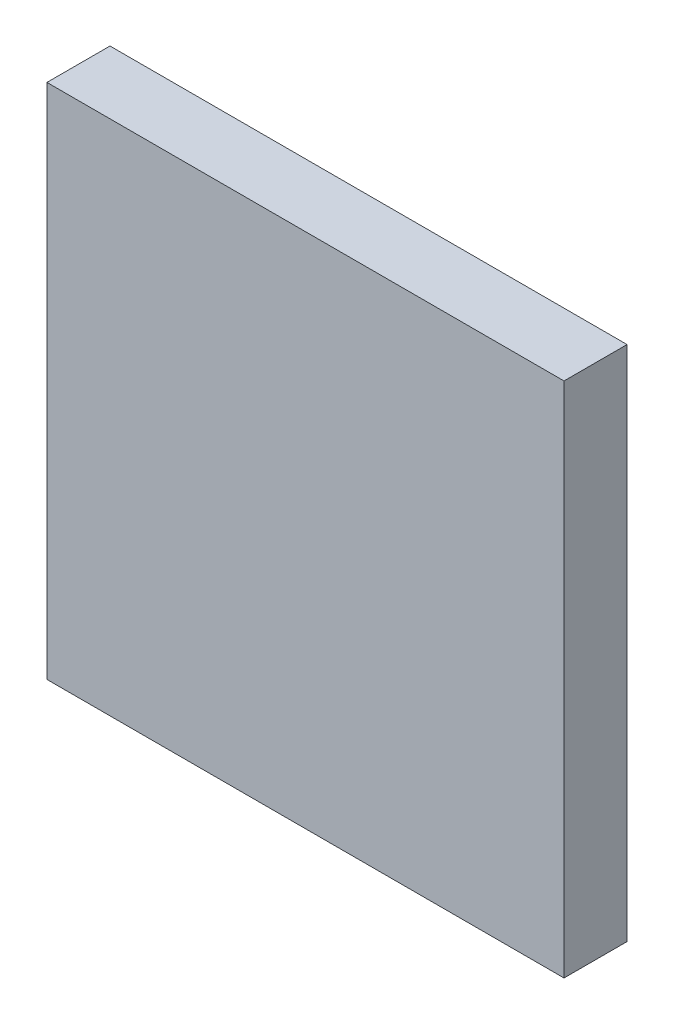
ISO-10303-21;
HEADER;
FILE_DESCRIPTION(('STEP AP214'),'2;1');
FILE_NAME('part.step','',(''),(''),'','','');
FILE_SCHEMA(('AUTOMOTIVE_DESIGN { 1 0 10303 214 1 1 1 1 }'));
ENDSEC;
DATA;
#1=APPLICATION_CONTEXT('core data for automotive mechanical design processes');
#2=APPLICATION_PROTOCOL_DEFINITION('international standard','automotive_design',2000,#1);
#3=PRODUCT_CONTEXT('',#1,'mechanical');
#4=PRODUCT('Part','Part','',(#3));
#5=PRODUCT_RELATED_PRODUCT_CATEGORY('part','',(#4));
#6=PRODUCT_DEFINITION_FORMATION('','',#4);
#7=PRODUCT_DEFINITION_CONTEXT('part definition',#1,'design');
#8=PRODUCT_DEFINITION('design','',#6,#7);
#9=PRODUCT_DEFINITION_SHAPE('','',#8);
#10=(LENGTH_UNIT() NAMED_UNIT(*) SI_UNIT(.MILLI.,.METRE.));
#11=(NAMED_UNIT(*) PLANE_ANGLE_UNIT() SI_UNIT($,.RADIAN.));
#12=(NAMED_UNIT(*) SI_UNIT($,.STERADIAN.) SOLID_ANGLE_UNIT());
#13=UNCERTAINTY_MEASURE_WITH_UNIT(LENGTH_MEASURE(1.E-05),#10,'distance_accuracy_value','');
#14=(GEOMETRIC_REPRESENTATION_CONTEXT(3) GLOBAL_UNCERTAINTY_ASSIGNED_CONTEXT((#13)) GLOBAL_UNIT_ASSIGNED_CONTEXT((#10,
#11,#12)) REPRESENTATION_CONTEXT('',''));
#15=CARTESIAN_POINT('',(0.,0.,0.));
#16=DIRECTION('',(0.,0.,1.));
#17=DIRECTION('',(1.,0.,0.));
#18=AXIS2_PLACEMENT_3D('',#15,#16,#17);
#19=CARTESIAN_POINT('',(-2.04999844,-2.04999844,0.499999));
#20=DIRECTION('',(0.,0.,-1.));
#21=DIRECTION('',(-1.,0.,0.));
#22=AXIS2_PLACEMENT_3D('',#19,#20,#21);
#23=PLANE('',#22);
#24=DIRECTION('',(0.,1.,0.));
#25=VECTOR('',#24,1.);
#26=CARTESIAN_POINT('',(2.05000098,-2.04999844,0.499999));
#27=LINE('',#26,#25);
#28=CARTESIAN_POINT('',(2.05000098,-2.04999844,0.499999));
#29=VERTEX_POINT('',#28);
#30=CARTESIAN_POINT('',(2.05000098,2.05000098,0.499999));
#31=VERTEX_POINT('',#30);
#32=EDGE_CURVE('E54',#29,#31,#27,.T.);
#33=ORIENTED_EDGE('',*,*,#32,.T.);
#34=DIRECTION('',(1.,0.,0.));
#35=VECTOR('',#34,1.);
#36=CARTESIAN_POINT('',(2.05000098,2.05000098,0.499999));
#37=LINE('',#36,#35);
#38=CARTESIAN_POINT('',(-2.04999844,2.05000098,0.499999));
#39=VERTEX_POINT('',#38);
#40=EDGE_CURVE('E56',#31,#39,#37,.F.);
#41=ORIENTED_EDGE('',*,*,#40,.T.);
#42=DIRECTION('',(0.,1.,0.));
#43=VECTOR('',#42,1.);
#44=CARTESIAN_POINT('',(-2.04999844,2.05000098,0.499999));
#45=LINE('',#44,#43);
#46=CARTESIAN_POINT('',(-2.04999844,-2.04999844,0.499999));
#47=VERTEX_POINT('',#46);
#48=EDGE_CURVE('E19',#39,#47,#45,.F.);
#49=ORIENTED_EDGE('',*,*,#48,.T.);
#50=DIRECTION('',(1.,0.,0.));
#51=VECTOR('',#50,1.);
#52=CARTESIAN_POINT('',(-2.04999844,-2.04999844,0.499999));
#53=LINE('',#52,#51);
#54=EDGE_CURVE('E79',#47,#29,#53,.T.);
#55=ORIENTED_EDGE('',*,*,#54,.T.);
#56=EDGE_LOOP('',(#33,#41,#49,#55));
#57=FACE_BOUND('',#56,.T.);
#58=ADVANCED_FACE('F16',(#57),#23,.F.);
#59=CARTESIAN_POINT('',(-2.04999844,2.05000098,0.));
#60=DIRECTION('',(1.,0.,0.));
#61=DIRECTION('',(0.,0.,-1.));
#62=AXIS2_PLACEMENT_3D('',#59,#60,#61);
#63=PLANE('',#62);
#64=DIRECTION('',(0.,0.,1.));
#65=VECTOR('',#64,1.);
#66=CARTESIAN_POINT('',(-2.04999844,-2.04999844,0.));
#67=LINE('',#66,#65);
#68=CARTESIAN_POINT('',(-2.04999844,-2.04999844,0.));
#69=VERTEX_POINT('',#68);
#70=EDGE_CURVE('E67',#69,#47,#67,.T.);
#71=ORIENTED_EDGE('',*,*,#70,.T.);
#72=ORIENTED_EDGE('',*,*,#48,.F.);
#73=DIRECTION('',(0.,0.,-1.));
#74=VECTOR('',#73,1.);
#75=CARTESIAN_POINT('',(-2.04999844,2.05000098,0.));
#76=LINE('',#75,#74);
#77=CARTESIAN_POINT('',(-2.04999844,2.05000098,0.));
#78=VERTEX_POINT('',#77);
#79=EDGE_CURVE('E62',#39,#78,#76,.T.);
#80=ORIENTED_EDGE('',*,*,#79,.T.);
#81=DIRECTION('',(0.,1.,0.));
#82=VECTOR('',#81,1.);
#83=CARTESIAN_POINT('',(-2.04999844,-2.04999844,0.));
#84=LINE('',#83,#82);
#85=EDGE_CURVE('E82',#69,#78,#84,.T.);
#86=ORIENTED_EDGE('',*,*,#85,.F.);
#87=EDGE_LOOP('',(#71,#72,#80,#86));
#88=FACE_BOUND('',#87,.T.);
#89=ADVANCED_FACE('F64',(#88),#63,.F.);
#90=CARTESIAN_POINT('',(2.05000098,2.05000098,0.));
#91=DIRECTION('',(0.,-1.,0.));
#92=DIRECTION('',(0.,0.,-1.));
#93=AXIS2_PLACEMENT_3D('',#90,#91,#92);
#94=PLANE('',#93);
#95=ORIENTED_EDGE('',*,*,#79,.F.);
#96=ORIENTED_EDGE('',*,*,#40,.F.);
#97=DIRECTION('',(0.,0.,1.));
#98=VECTOR('',#97,1.);
#99=CARTESIAN_POINT('',(2.05000098,2.05000098,0.));
#100=LINE('',#99,#98);
#101=CARTESIAN_POINT('',(2.05000098,2.05000098,0.));
#102=VERTEX_POINT('',#101);
#103=EDGE_CURVE('E74',#31,#102,#100,.F.);
#104=ORIENTED_EDGE('',*,*,#103,.T.);
#105=DIRECTION('',(-1.,0.,0.));
#106=VECTOR('',#105,1.);
#107=CARTESIAN_POINT('',(-2.04999844,2.05000098,0.));
#108=LINE('',#107,#106);
#109=EDGE_CURVE('E71',#78,#102,#108,.F.);
#110=ORIENTED_EDGE('',*,*,#109,.F.);
#111=EDGE_LOOP('',(#95,#96,#104,#110));
#112=FACE_BOUND('',#111,.T.);
#113=ADVANCED_FACE('F69',(#112),#94,.F.);
#114=CARTESIAN_POINT('',(2.05000098,-2.04999844,0.));
#115=DIRECTION('',(-1.,0.,0.));
#116=DIRECTION('',(0.,0.,1.));
#117=AXIS2_PLACEMENT_3D('',#114,#115,#116);
#118=PLANE('',#117);
#119=ORIENTED_EDGE('',*,*,#103,.F.);
#120=ORIENTED_EDGE('',*,*,#32,.F.);
#121=DIRECTION('',(0.,0.,1.));
#122=VECTOR('',#121,1.);
#123=CARTESIAN_POINT('',(2.05000098,-2.04999844,0.));
#124=LINE('',#123,#122);
#125=CARTESIAN_POINT('',(2.05000098,-2.04999844,0.));
#126=VERTEX_POINT('',#125);
#127=EDGE_CURVE('E34',#29,#126,#124,.F.);
#128=ORIENTED_EDGE('',*,*,#127,.T.);
#129=DIRECTION('',(0.,1.,0.));
#130=VECTOR('',#129,1.);
#131=CARTESIAN_POINT('',(2.05000098,-2.04999844,0.));
#132=LINE('',#131,#130);
#133=EDGE_CURVE('E25',#102,#126,#132,.F.);
#134=ORIENTED_EDGE('',*,*,#133,.F.);
#135=EDGE_LOOP('',(#119,#120,#128,#134));
#136=FACE_BOUND('',#135,.T.);
#137=ADVANCED_FACE('F88',(#136),#118,.F.);
#138=CARTESIAN_POINT('',(-2.04999844,-2.04999844,0.));
#139=DIRECTION('',(0.,1.,0.));
#140=DIRECTION('',(0.,0.,1.));
#141=AXIS2_PLACEMENT_3D('',#138,#139,#140);
#142=PLANE('',#141);
#143=ORIENTED_EDGE('',*,*,#127,.F.);
#144=ORIENTED_EDGE('',*,*,#54,.F.);
#145=ORIENTED_EDGE('',*,*,#70,.F.);
#146=DIRECTION('',(-1.,0.,0.));
#147=VECTOR('',#146,1.);
#148=CARTESIAN_POINT('',(-2.04999844,-2.04999844,0.));
#149=LINE('',#148,#147);
#150=EDGE_CURVE('E11',#126,#69,#149,.T.);
#151=ORIENTED_EDGE('',*,*,#150,.F.);
#152=EDGE_LOOP('',(#143,#144,#145,#151));
#153=FACE_BOUND('',#152,.T.);
#154=ADVANCED_FACE('F90',(#153),#142,.F.);
#155=CARTESIAN_POINT('',(-2.04999844,-2.04999844,0.));
#156=DIRECTION('',(0.,0.,-1.));
#157=DIRECTION('',(-1.,0.,0.));
#158=AXIS2_PLACEMENT_3D('',#155,#156,#157);
#159=PLANE('',#158);
#160=ORIENTED_EDGE('',*,*,#133,.T.);
#161=ORIENTED_EDGE('',*,*,#150,.T.);
#162=ORIENTED_EDGE('',*,*,#85,.T.);
#163=ORIENTED_EDGE('',*,*,#109,.T.);
#164=EDGE_LOOP('',(#160,#161,#162,#163));
#165=FACE_BOUND('',#164,.T.);
#166=ADVANCED_FACE('F87',(#165),#159,.T.);
#167=CLOSED_SHELL('',(#58,#89,#113,#137,#154,#166));
#168=MANIFOLD_SOLID_BREP('B1',#167);
#169=ADVANCED_BREP_SHAPE_REPRESENTATION('',(#18,#168),#14);
#170=SHAPE_DEFINITION_REPRESENTATION(#9,#169);
ENDSEC;
END-ISO-10303-21;
